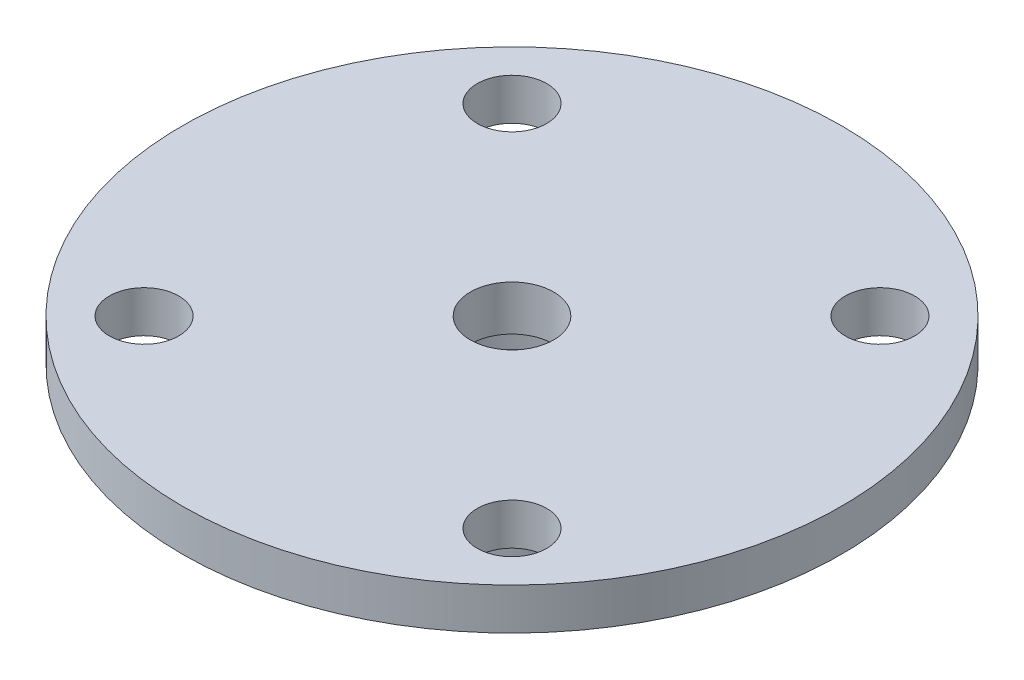
ISO-10303-21;
HEADER;
FILE_DESCRIPTION(('STEP AP214'),'2;1');
FILE_NAME('part.step','',(''),(''),'','','');
FILE_SCHEMA(('AUTOMOTIVE_DESIGN { 1 0 10303 214 1 1 1 1 }'));
ENDSEC;
DATA;
#1=APPLICATION_CONTEXT('core data for automotive mechanical design processes');
#2=APPLICATION_PROTOCOL_DEFINITION('international standard','automotive_design',2000,#1);
#3=PRODUCT_CONTEXT('',#1,'mechanical');
#4=PRODUCT('Part','Part','',(#3));
#5=PRODUCT_RELATED_PRODUCT_CATEGORY('part','',(#4));
#6=PRODUCT_DEFINITION_FORMATION('','',#4);
#7=PRODUCT_DEFINITION_CONTEXT('part definition',#1,'design');
#8=PRODUCT_DEFINITION('design','',#6,#7);
#9=PRODUCT_DEFINITION_SHAPE('','',#8);
#10=(LENGTH_UNIT() NAMED_UNIT(*) SI_UNIT(.MILLI.,.METRE.));
#11=(NAMED_UNIT(*) PLANE_ANGLE_UNIT() SI_UNIT($,.RADIAN.));
#12=(NAMED_UNIT(*) SI_UNIT($,.STERADIAN.) SOLID_ANGLE_UNIT());
#13=UNCERTAINTY_MEASURE_WITH_UNIT(LENGTH_MEASURE(1.E-05),#10,'distance_accuracy_value','');
#14=(GEOMETRIC_REPRESENTATION_CONTEXT(3) GLOBAL_UNCERTAINTY_ASSIGNED_CONTEXT((#13)) GLOBAL_UNIT_ASSIGNED_CONTEXT((#10,
#11,#12)) REPRESENTATION_CONTEXT('',''));
#15=CARTESIAN_POINT('',(0.,0.,0.));
#16=DIRECTION('',(0.,0.,1.));
#17=DIRECTION('',(1.,0.,0.));
#18=AXIS2_PLACEMENT_3D('',#15,#16,#17);
#19=CARTESIAN_POINT('',(-19.9372146502712,-3.8,8.38605823860318));
#20=DIRECTION('',(0.,1.,0.));
#21=DIRECTION('',(0.,0.,1.));
#22=AXIS2_PLACEMENT_3D('',#19,#20,#21);
#23=CYLINDRICAL_SURFACE('',#22,1.2);
#24=CARTESIAN_POINT('',(-19.9372146502712,1.2,8.38605823860318));
#25=DIRECTION('',(0.,1.,0.));
#26=DIRECTION('',(0.,0.,1.));
#27=AXIS2_PLACEMENT_3D('',#24,#25,#26);
#28=CIRCLE('',#27,1.2);
#29=CARTESIAN_POINT('',(-19.9372146502712,1.2,9.58605823860318));
#30=VERTEX_POINT('',#29);
#31=EDGE_CURVE('E75',#30,#30,#28,.T.);
#32=ORIENTED_EDGE('',*,*,#31,.T.);
#33=EDGE_LOOP('',(#32));
#34=FACE_BOUND('',#33,.T.);
#35=CARTESIAN_POINT('',(-19.9372146502712,-0.1,8.38605823860318));
#36=DIRECTION('',(0.,-1.,0.));
#37=DIRECTION('',(0.,0.,-1.));
#38=AXIS2_PLACEMENT_3D('',#35,#36,#37);
#39=CIRCLE('',#38,1.2);
#40=CARTESIAN_POINT('',(-19.9372146502712,-0.1,7.18605823860318));
#41=VERTEX_POINT('',#40);
#42=EDGE_CURVE('E35',#41,#41,#39,.F.);
#43=ORIENTED_EDGE('',*,*,#42,.F.);
#44=EDGE_LOOP('',(#43));
#45=FACE_BOUND('',#44,.T.);
#46=ADVANCED_FACE('F31',(#34,#45),#23,.F.);
#47=CARTESIAN_POINT('',(-19.9372146502712,0.,8.38605823860318));
#48=DIRECTION('',(0.,1.,0.));
#49=DIRECTION('',(0.,0.,1.));
#50=AXIS2_PLACEMENT_3D('',#47,#48,#49);
#51=PLANE('',#50);
#52=CARTESIAN_POINT('',(-19.9372146502712,0.,8.38605823860318));
#53=DIRECTION('',(0.,1.,0.));
#54=DIRECTION('',(0.,0.,1.));
#55=AXIS2_PLACEMENT_3D('',#52,#53,#54);
#56=CIRCLE('',#55,9.5);
#57=CARTESIAN_POINT('',(-19.9372146502712,0.,17.8860582386032));
#58=VERTEX_POINT('',#57);
#59=EDGE_CURVE('E43',#58,#58,#56,.T.);
#60=ORIENTED_EDGE('',*,*,#59,.F.);
#61=EDGE_LOOP('',(#60));
#62=FACE_BOUND('',#61,.T.);
#63=CARTESIAN_POINT('',(-14.6339137913721,0.,3.08275737970408));
#64=DIRECTION('',(0.,1.,0.));
#65=DIRECTION('',(0.,0.,1.));
#66=AXIS2_PLACEMENT_3D('',#63,#64,#65);
#67=CIRCLE('',#66,1.);
#68=CARTESIAN_POINT('',(-14.6339137913721,0.,4.08275737970408));
#69=VERTEX_POINT('',#68);
#70=EDGE_CURVE('E49',#69,#69,#67,.T.);
#71=ORIENTED_EDGE('',*,*,#70,.T.);
#72=EDGE_LOOP('',(#71));
#73=FACE_BOUND('',#72,.T.);
#74=CARTESIAN_POINT('',(-14.6339137913721,0.,13.6893590975023));
#75=DIRECTION('',(0.,1.,0.));
#76=DIRECTION('',(0.,0.,1.));
#77=AXIS2_PLACEMENT_3D('',#74,#75,#76);
#78=CIRCLE('',#77,1.);
#79=CARTESIAN_POINT('',(-14.6339137913721,0.,14.6893590975023));
#80=VERTEX_POINT('',#79);
#81=EDGE_CURVE('E55',#80,#80,#78,.T.);
#82=ORIENTED_EDGE('',*,*,#81,.T.);
#83=EDGE_LOOP('',(#82));
#84=FACE_BOUND('',#83,.T.);
#85=CARTESIAN_POINT('',(-25.2405155091703,0.,13.6893590975023));
#86=DIRECTION('',(0.,1.,0.));
#87=DIRECTION('',(0.,0.,1.));
#88=AXIS2_PLACEMENT_3D('',#85,#86,#87);
#89=CIRCLE('',#88,1.);
#90=CARTESIAN_POINT('',(-25.2405155091703,0.,14.6893590975023));
#91=VERTEX_POINT('',#90);
#92=EDGE_CURVE('E61',#91,#91,#89,.T.);
#93=ORIENTED_EDGE('',*,*,#92,.T.);
#94=EDGE_LOOP('',(#93));
#95=FACE_BOUND('',#94,.T.);
#96=CARTESIAN_POINT('',(-25.2405155091703,0.,3.08275737970408));
#97=DIRECTION('',(0.,1.,0.));
#98=DIRECTION('',(0.,0.,1.));
#99=AXIS2_PLACEMENT_3D('',#96,#97,#98);
#100=CIRCLE('',#99,1.);
#101=CARTESIAN_POINT('',(-25.2405155091703,0.,4.08275737970408));
#102=VERTEX_POINT('',#101);
#103=EDGE_CURVE('E67',#102,#102,#100,.T.);
#104=ORIENTED_EDGE('',*,*,#103,.T.);
#105=EDGE_LOOP('',(#104));
#106=FACE_BOUND('',#105,.T.);
#107=CARTESIAN_POINT('',(-19.9372146502712,0.,8.38605823860318));
#108=DIRECTION('',(0.,1.,0.));
#109=DIRECTION('',(0.,0.,1.));
#110=AXIS2_PLACEMENT_3D('',#107,#108,#109);
#111=CIRCLE('',#110,4.5);
#112=CARTESIAN_POINT('',(-19.9372146502712,0.,12.8860582386032));
#113=VERTEX_POINT('',#112);
#114=EDGE_CURVE('E10',#113,#113,#111,.F.);
#115=ORIENTED_EDGE('',*,*,#114,.F.);
#116=EDGE_LOOP('',(#115));
#117=FACE_BOUND('',#116,.T.);
#118=ADVANCED_FACE('F91',(#62,#73,#84,#95,#106,#117),#51,.F.);
#119=CARTESIAN_POINT('',(-19.9372146502712,1.2,8.38605823860318));
#120=DIRECTION('',(0.,1.,0.));
#121=DIRECTION('',(0.,0.,1.));
#122=AXIS2_PLACEMENT_3D('',#119,#120,#121);
#123=PLANE('',#122);
#124=ORIENTED_EDGE('',*,*,#31,.F.);
#125=EDGE_LOOP('',(#124));
#126=FACE_BOUND('',#125,.T.);
#127=CARTESIAN_POINT('',(-25.2405155091703,1.2,13.6893590975023));
#128=DIRECTION('',(0.,1.,0.));
#129=DIRECTION('',(0.,0.,1.));
#130=AXIS2_PLACEMENT_3D('',#127,#128,#129);
#131=CIRCLE('',#130,1.);
#132=CARTESIAN_POINT('',(-25.2405155091703,1.2,14.6893590975023));
#133=VERTEX_POINT('',#132);
#134=EDGE_CURVE('E58',#133,#133,#131,.T.);
#135=ORIENTED_EDGE('',*,*,#134,.F.);
#136=EDGE_LOOP('',(#135));
#137=FACE_BOUND('',#136,.T.);
#138=CARTESIAN_POINT('',(-14.6339137913721,1.2,3.08275737970408));
#139=DIRECTION('',(0.,1.,0.));
#140=DIRECTION('',(0.,0.,1.));
#141=AXIS2_PLACEMENT_3D('',#138,#139,#140);
#142=CIRCLE('',#141,1.);
#143=CARTESIAN_POINT('',(-14.6339137913721,1.2,4.08275737970408));
#144=VERTEX_POINT('',#143);
#145=EDGE_CURVE('E47',#144,#144,#142,.T.);
#146=ORIENTED_EDGE('',*,*,#145,.F.);
#147=EDGE_LOOP('',(#146));
#148=FACE_BOUND('',#147,.T.);
#149=CARTESIAN_POINT('',(-19.9372146502712,1.2,8.38605823860318));
#150=DIRECTION('',(0.,1.,0.));
#151=DIRECTION('',(0.,0.,1.));
#152=AXIS2_PLACEMENT_3D('',#149,#150,#151);
#153=CIRCLE('',#152,9.5);
#154=CARTESIAN_POINT('',(-19.9372146502712,1.2,17.8860582386032));
#155=VERTEX_POINT('',#154);
#156=EDGE_CURVE('E39',#155,#155,#153,.T.);
#157=ORIENTED_EDGE('',*,*,#156,.T.);
#158=EDGE_LOOP('',(#157));
#159=FACE_BOUND('',#158,.T.);
#160=CARTESIAN_POINT('',(-14.6339137913721,1.2,13.6893590975023));
#161=DIRECTION('',(0.,1.,0.));
#162=DIRECTION('',(0.,0.,1.));
#163=AXIS2_PLACEMENT_3D('',#160,#161,#162);
#164=CIRCLE('',#163,1.);
#165=CARTESIAN_POINT('',(-14.6339137913721,1.2,14.6893590975023));
#166=VERTEX_POINT('',#165);
#167=EDGE_CURVE('E52',#166,#166,#164,.T.);
#168=ORIENTED_EDGE('',*,*,#167,.F.);
#169=EDGE_LOOP('',(#168));
#170=FACE_BOUND('',#169,.T.);
#171=CARTESIAN_POINT('',(-25.2405155091703,1.2,3.08275737970408));
#172=DIRECTION('',(0.,1.,0.));
#173=DIRECTION('',(0.,0.,1.));
#174=AXIS2_PLACEMENT_3D('',#171,#172,#173);
#175=CIRCLE('',#174,1.);
#176=CARTESIAN_POINT('',(-25.2405155091703,1.2,4.08275737970408));
#177=VERTEX_POINT('',#176);
#178=EDGE_CURVE('E64',#177,#177,#175,.T.);
#179=ORIENTED_EDGE('',*,*,#178,.F.);
#180=EDGE_LOOP('',(#179));
#181=FACE_BOUND('',#180,.T.);
#182=ADVANCED_FACE('F97',(#126,#137,#148,#159,#170,#181),#123,.T.);
#183=CARTESIAN_POINT('',(-19.9372146502712,1.2,8.38605823860318));
#184=DIRECTION('',(0.,-1.,0.));
#185=DIRECTION('',(0.,0.,-1.));
#186=AXIS2_PLACEMENT_3D('',#183,#184,#185);
#187=CYLINDRICAL_SURFACE('',#186,9.5);
#188=ORIENTED_EDGE('',*,*,#156,.F.);
#189=EDGE_LOOP('',(#188));
#190=FACE_BOUND('',#189,.T.);
#191=ORIENTED_EDGE('',*,*,#59,.T.);
#192=EDGE_LOOP('',(#191));
#193=FACE_BOUND('',#192,.T.);
#194=ADVANCED_FACE('F33',(#190,#193),#187,.T.);
#195=CARTESIAN_POINT('',(-14.6339137913721,1.2,3.08275737970408));
#196=DIRECTION('',(0.,-1.,0.));
#197=DIRECTION('',(0.,0.,-1.));
#198=AXIS2_PLACEMENT_3D('',#195,#196,#197);
#199=CYLINDRICAL_SURFACE('',#198,1.);
#200=ORIENTED_EDGE('',*,*,#145,.T.);
#201=EDGE_LOOP('',(#200));
#202=FACE_BOUND('',#201,.T.);
#203=ORIENTED_EDGE('',*,*,#70,.F.);
#204=EDGE_LOOP('',(#203));
#205=FACE_BOUND('',#204,.T.);
#206=ADVANCED_FACE('F122',(#202,#205),#199,.F.);
#207=CARTESIAN_POINT('',(-14.6339137913721,1.2,13.6893590975023));
#208=DIRECTION('',(0.,-1.,0.));
#209=DIRECTION('',(0.,0.,-1.));
#210=AXIS2_PLACEMENT_3D('',#207,#208,#209);
#211=CYLINDRICAL_SURFACE('',#210,1.);
#212=ORIENTED_EDGE('',*,*,#167,.T.);
#213=EDGE_LOOP('',(#212));
#214=FACE_BOUND('',#213,.T.);
#215=ORIENTED_EDGE('',*,*,#81,.F.);
#216=EDGE_LOOP('',(#215));
#217=FACE_BOUND('',#216,.T.);
#218=ADVANCED_FACE('F118',(#214,#217),#211,.F.);
#219=CARTESIAN_POINT('',(-25.2405155091703,1.2,13.6893590975023));
#220=DIRECTION('',(0.,-1.,0.));
#221=DIRECTION('',(0.,0.,-1.));
#222=AXIS2_PLACEMENT_3D('',#219,#220,#221);
#223=CYLINDRICAL_SURFACE('',#222,1.);
#224=ORIENTED_EDGE('',*,*,#134,.T.);
#225=EDGE_LOOP('',(#224));
#226=FACE_BOUND('',#225,.T.);
#227=ORIENTED_EDGE('',*,*,#92,.F.);
#228=EDGE_LOOP('',(#227));
#229=FACE_BOUND('',#228,.T.);
#230=ADVANCED_FACE('F114',(#226,#229),#223,.F.);
#231=CARTESIAN_POINT('',(-25.2405155091703,1.2,3.08275737970408));
#232=DIRECTION('',(0.,-1.,0.));
#233=DIRECTION('',(0.,0.,-1.));
#234=AXIS2_PLACEMENT_3D('',#231,#232,#233);
#235=CYLINDRICAL_SURFACE('',#234,1.);
#236=ORIENTED_EDGE('',*,*,#178,.T.);
#237=EDGE_LOOP('',(#236));
#238=FACE_BOUND('',#237,.T.);
#239=ORIENTED_EDGE('',*,*,#103,.F.);
#240=EDGE_LOOP('',(#239));
#241=FACE_BOUND('',#240,.T.);
#242=ADVANCED_FACE('F110',(#238,#241),#235,.F.);
#243=CARTESIAN_POINT('',(-19.9372146502712,-2.,8.38605823860318));
#244=DIRECTION('',(0.,1.,0.));
#245=DIRECTION('',(0.,0.,1.));
#246=AXIS2_PLACEMENT_3D('',#243,#244,#245);
#247=CYLINDRICAL_SURFACE('',#246,4.5);
#248=CARTESIAN_POINT('',(-19.9372146502712,-2.,8.38605823860318));
#249=DIRECTION('',(0.,-1.,0.));
#250=DIRECTION('',(0.,0.,-1.));
#251=AXIS2_PLACEMENT_3D('',#248,#249,#250);
#252=CIRCLE('',#251,4.5);
#253=CARTESIAN_POINT('',(-19.9372146502712,-2.,3.88605823860318));
#254=VERTEX_POINT('',#253);
#255=EDGE_CURVE('E70',#254,#254,#252,.T.);
#256=ORIENTED_EDGE('',*,*,#255,.F.);
#257=EDGE_LOOP('',(#256));
#258=FACE_BOUND('',#257,.T.);
#259=ORIENTED_EDGE('',*,*,#114,.T.);
#260=EDGE_LOOP('',(#259));
#261=FACE_BOUND('',#260,.T.);
#262=ADVANCED_FACE('F106',(#258,#261),#247,.T.);
#263=CARTESIAN_POINT('',(-19.9372146502712,-2.,8.38605823860318));
#264=DIRECTION('',(0.,-1.,0.));
#265=DIRECTION('',(0.,0.,-1.));
#266=AXIS2_PLACEMENT_3D('',#263,#264,#265);
#267=PLANE('',#266);
#268=CARTESIAN_POINT('',(-19.9372146502712,-2.,8.38605823860318));
#269=DIRECTION('',(0.,-1.,0.));
#270=DIRECTION('',(0.,0.,-1.));
#271=AXIS2_PLACEMENT_3D('',#268,#269,#270);
#272=CIRCLE('',#271,3.35);
#273=CARTESIAN_POINT('',(-19.9372146502712,-2.,5.03605823860318));
#274=VERTEX_POINT('',#273);
#275=EDGE_CURVE('E78',#274,#274,#272,.T.);
#276=ORIENTED_EDGE('',*,*,#275,.F.);
#277=EDGE_LOOP('',(#276));
#278=FACE_BOUND('',#277,.T.);
#279=ORIENTED_EDGE('',*,*,#255,.T.);
#280=EDGE_LOOP('',(#279));
#281=FACE_BOUND('',#280,.T.);
#282=ADVANCED_FACE('F103',(#278,#281),#267,.T.);
#283=CARTESIAN_POINT('',(-19.9372146502712,-0.1,8.38605823860318));
#284=DIRECTION('',(0.,-1.,0.));
#285=DIRECTION('',(0.,0.,-1.));
#286=AXIS2_PLACEMENT_3D('',#283,#284,#285);
#287=PLANE('',#286);
#288=CARTESIAN_POINT('',(-19.9372146502712,-0.1,8.38605823860318));
#289=DIRECTION('',(0.,-1.,0.));
#290=DIRECTION('',(0.,0.,-1.));
#291=AXIS2_PLACEMENT_3D('',#288,#289,#290);
#292=CIRCLE('',#291,3.35);
#293=CARTESIAN_POINT('',(-19.9372146502712,-0.1,5.03605823860318));
#294=VERTEX_POINT('',#293);
#295=EDGE_CURVE('E81',#294,#294,#292,.T.);
#296=ORIENTED_EDGE('',*,*,#295,.T.);
#297=EDGE_LOOP('',(#296));
#298=FACE_BOUND('',#297,.T.);
#299=ORIENTED_EDGE('',*,*,#42,.T.);
#300=EDGE_LOOP('',(#299));
#301=FACE_BOUND('',#300,.T.);
#302=ADVANCED_FACE('F88',(#298,#301),#287,.T.);
#303=CARTESIAN_POINT('',(-19.9372146502712,-0.1,8.38605823860318));
#304=DIRECTION('',(0.,-1.,0.));
#305=DIRECTION('',(0.,0.,-1.));
#306=AXIS2_PLACEMENT_3D('',#303,#304,#305);
#307=CYLINDRICAL_SURFACE('',#306,3.35);
#308=ORIENTED_EDGE('',*,*,#295,.F.);
#309=EDGE_LOOP('',(#308));
#310=FACE_BOUND('',#309,.T.);
#311=ORIENTED_EDGE('',*,*,#275,.T.);
#312=EDGE_LOOP('',(#311));
#313=FACE_BOUND('',#312,.T.);
#314=ADVANCED_FACE('F101',(#310,#313),#307,.F.);
#315=CLOSED_SHELL('',(#46,#118,#182,#194,#206,#218,#230,#242,#262,#282,#302,#314));
#316=MANIFOLD_SOLID_BREP('B2',#315);
#317=ADVANCED_BREP_SHAPE_REPRESENTATION('',(#18,#316),#14);
#318=SHAPE_DEFINITION_REPRESENTATION(#9,#317);
ENDSEC;
END-ISO-10303-21;
